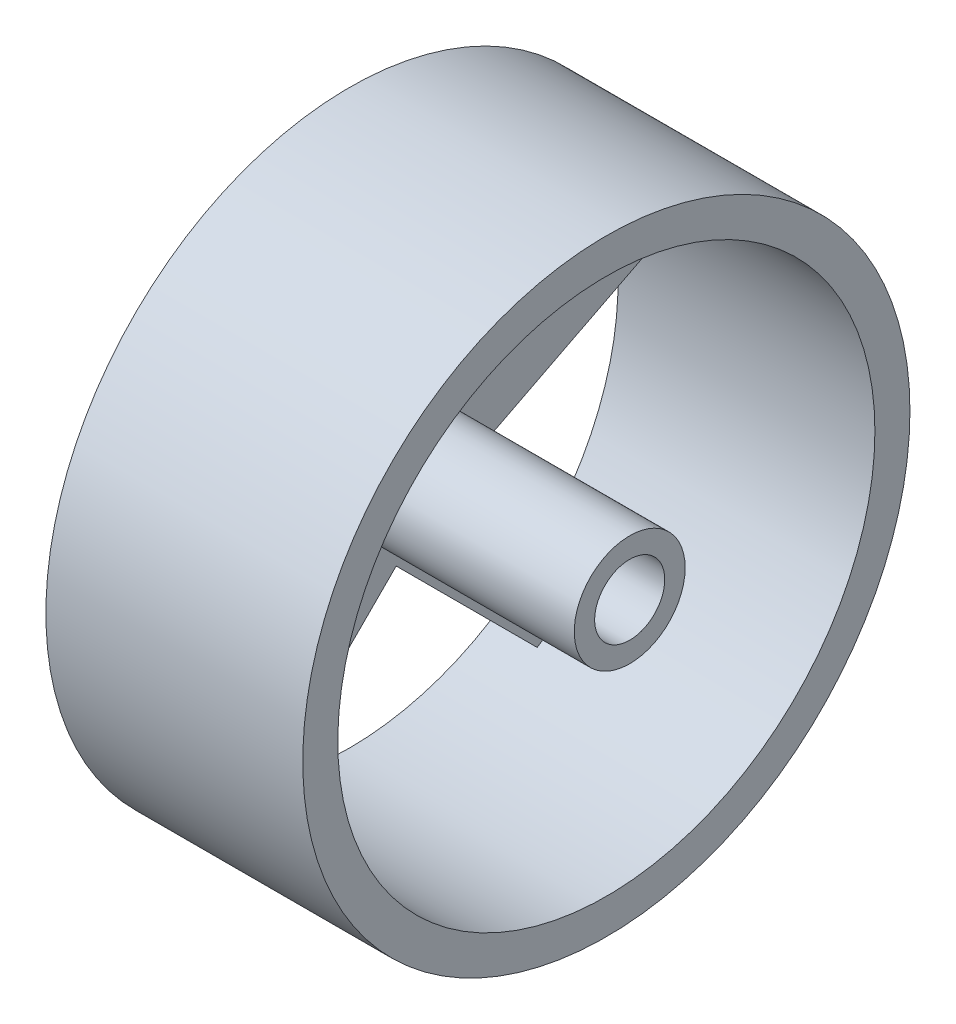
ISO-10303-21;
HEADER;
FILE_DESCRIPTION(('STEP AP214'),'2;1');
FILE_NAME('part.step','',(''),(''),'','','');
FILE_SCHEMA(('AUTOMOTIVE_DESIGN { 1 0 10303 214 1 1 1 1 }'));
ENDSEC;
DATA;
#1=APPLICATION_CONTEXT('core data for automotive mechanical design processes');
#2=APPLICATION_PROTOCOL_DEFINITION('international standard','automotive_design',2000,#1);
#3=PRODUCT_CONTEXT('',#1,'mechanical');
#4=PRODUCT('Part','Part','',(#3));
#5=PRODUCT_RELATED_PRODUCT_CATEGORY('part','',(#4));
#6=PRODUCT_DEFINITION_FORMATION('','',#4);
#7=PRODUCT_DEFINITION_CONTEXT('part definition',#1,'design');
#8=PRODUCT_DEFINITION('design','',#6,#7);
#9=PRODUCT_DEFINITION_SHAPE('','',#8);
#10=(LENGTH_UNIT() NAMED_UNIT(*) SI_UNIT(.MILLI.,.METRE.));
#11=(NAMED_UNIT(*) PLANE_ANGLE_UNIT() SI_UNIT($,.RADIAN.));
#12=(NAMED_UNIT(*) SI_UNIT($,.STERADIAN.) SOLID_ANGLE_UNIT());
#13=UNCERTAINTY_MEASURE_WITH_UNIT(LENGTH_MEASURE(1.E-05),#10,'distance_accuracy_value','');
#14=(GEOMETRIC_REPRESENTATION_CONTEXT(3) GLOBAL_UNCERTAINTY_ASSIGNED_CONTEXT((#13)) GLOBAL_UNIT_ASSIGNED_CONTEXT((#10,
#11,#12)) REPRESENTATION_CONTEXT('',''));
#15=CARTESIAN_POINT('',(0.,0.,0.));
#16=DIRECTION('',(0.,0.,1.));
#17=DIRECTION('',(1.,0.,0.));
#18=AXIS2_PLACEMENT_3D('',#15,#16,#17);
#19=CARTESIAN_POINT('',(4.,0.,0.));
#20=DIRECTION('',(1.,0.,0.));
#21=DIRECTION('',(0.,0.,-1.));
#22=AXIS2_PLACEMENT_3D('',#19,#20,#21);
#23=PLANE('',#22);
#24=DIRECTION('',(0.,-0.987688340595137,-0.156434465040233));
#25=VECTOR('',#24,1.);
#26=CARTESIAN_POINT('',(4.,22.9343179970492,-1.7369680510093));
#27=LINE('',#26,#25);
#28=CARTESIAN_POINT('',(4.,22.9343179970492,-1.7369680510093));
#29=VERTEX_POINT('',#28);
#30=CARTESIAN_POINT('',(4.,6.0676274578121,-4.40838939219355));
#31=VERTEX_POINT('',#30);
#32=EDGE_CURVE('E60',#29,#31,#27,.T.);
#33=ORIENTED_EDGE('',*,*,#32,.F.);
#34=CARTESIAN_POINT('',(4.,0.,0.));
#35=DIRECTION('',(1.,0.,0.));
#36=DIRECTION('',(0.,0.,-1.));
#37=AXIS2_PLACEMENT_3D('',#34,#35,#36);
#38=CIRCLE('',#37,23.);
#39=CARTESIAN_POINT('',(4.,22.9343179970492,1.7369680510093));
#40=VERTEX_POINT('',#39);
#41=EDGE_CURVE('E182',#40,#29,#38,.F.);
#42=ORIENTED_EDGE('',*,*,#41,.F.);
#43=DIRECTION('',(0.,0.987688340595137,-0.156434465040233));
#44=VECTOR('',#43,1.);
#45=CARTESIAN_POINT('',(4.,22.9343179970492,1.7369680510093));
#46=LINE('',#45,#44);
#47=CARTESIAN_POINT('',(4.,6.06762745781211,4.40838939219355));
#48=VERTEX_POINT('',#47);
#49=EDGE_CURVE('E232',#48,#40,#46,.T.);
#50=ORIENTED_EDGE('',*,*,#49,.F.);
#51=DIRECTION('',(0.,-0.156434465040229,-0.987688340595138));
#52=VECTOR('',#51,1.);
#53=CARTESIAN_POINT('',(4.,8.73904879899628,21.2750799314306));
#54=LINE('',#53,#52);
#55=CARTESIAN_POINT('',(4.,8.73904879899628,21.2750799314306));
#56=VERTEX_POINT('',#55);
#57=EDGE_CURVE('E180',#56,#48,#54,.T.);
#58=ORIENTED_EDGE('',*,*,#57,.F.);
#59=CARTESIAN_POINT('',(4.,5.4351392319785,22.348585224327));
#60=VERTEX_POINT('',#59);
#61=EDGE_CURVE('E158',#60,#56,#38,.F.);
#62=ORIENTED_EDGE('',*,*,#61,.F.);
#63=DIRECTION('',(0.,0.453990499739548,0.891006524188367));
#64=VECTOR('',#63,1.);
#65=CARTESIAN_POINT('',(4.,5.4351392319785,22.348585224327));
#66=LINE('',#65,#64);
#67=CARTESIAN_POINT('',(4.,-2.31762745781211,7.13292387221365));
#68=VERTEX_POINT('',#67);
#69=EDGE_CURVE('E169',#68,#60,#66,.T.);
#70=ORIENTED_EDGE('',*,*,#69,.F.);
#71=DIRECTION('',(0.,0.891006524188369,-0.453990499739545));
#72=VECTOR('',#71,1.);
#73=CARTESIAN_POINT('',(4.,-17.5332888099255,14.8856905620042));
#74=LINE('',#73,#72);
#75=CARTESIAN_POINT('',(4.,-17.5332888099255,14.8856905620042));
#76=VERTEX_POINT('',#75);
#77=EDGE_CURVE('E175',#76,#68,#74,.T.);
#78=ORIENTED_EDGE('',*,*,#77,.F.);
#79=CARTESIAN_POINT('',(4.,-19.5752172180984,12.0752172180985));
#80=VERTEX_POINT('',#79);
#81=EDGE_CURVE('E52',#80,#76,#38,.F.);
#82=ORIENTED_EDGE('',*,*,#81,.F.);
#83=DIRECTION('',(0.,-0.707106781186546,0.707106781186549));
#84=VECTOR('',#83,1.);
#85=CARTESIAN_POINT('',(4.,-19.5752172180984,12.0752172180985));
#86=LINE('',#85,#84);
#87=CARTESIAN_POINT('',(4.,-7.5,0.));
#88=VERTEX_POINT('',#87);
#89=EDGE_CURVE('E308',#88,#80,#86,.T.);
#90=ORIENTED_EDGE('',*,*,#89,.F.);
#91=DIRECTION('',(0.,0.707106781186546,0.707106781186549));
#92=VECTOR('',#91,1.);
#93=CARTESIAN_POINT('',(4.,-19.5752172180985,-12.0752172180985));
#94=LINE('',#93,#92);
#95=CARTESIAN_POINT('',(4.,-19.5752172180985,-12.0752172180985));
#96=VERTEX_POINT('',#95);
#97=EDGE_CURVE('E273',#96,#88,#94,.T.);
#98=ORIENTED_EDGE('',*,*,#97,.F.);
#99=CARTESIAN_POINT('',(4.,-17.5332888099255,-14.8856905620042));
#100=VERTEX_POINT('',#99);
#101=EDGE_CURVE('E11',#100,#96,#38,.F.);
#102=ORIENTED_EDGE('',*,*,#101,.F.);
#103=DIRECTION('',(0.,-0.891006524188369,-0.453990499739545));
#104=VECTOR('',#103,1.);
#105=CARTESIAN_POINT('',(4.,-17.5332888099255,-14.8856905620042));
#106=LINE('',#105,#104);
#107=CARTESIAN_POINT('',(4.,-2.31762745781211,-7.13292387221365));
#108=VERTEX_POINT('',#107);
#109=EDGE_CURVE('E253',#108,#100,#106,.T.);
#110=ORIENTED_EDGE('',*,*,#109,.F.);
#111=DIRECTION('',(0.,-0.453990499739549,0.891006524188367));
#112=VECTOR('',#111,1.);
#113=CARTESIAN_POINT('',(4.,5.43513923197851,-22.348585224327));
#114=LINE('',#113,#112);
#115=CARTESIAN_POINT('',(4.,5.43513923197851,-22.348585224327));
#116=VERTEX_POINT('',#115);
#117=EDGE_CURVE('E68',#116,#108,#114,.T.);
#118=ORIENTED_EDGE('',*,*,#117,.F.);
#119=CARTESIAN_POINT('',(4.,8.73904879899628,-21.2750799314306));
#120=VERTEX_POINT('',#119);
#121=EDGE_CURVE('E53',#120,#116,#38,.F.);
#122=ORIENTED_EDGE('',*,*,#121,.F.);
#123=DIRECTION('',(0.,0.156434465040229,-0.987688340595138));
#124=VECTOR('',#123,1.);
#125=CARTESIAN_POINT('',(4.,8.73904879899628,-21.2750799314306));
#126=LINE('',#125,#124);
#127=EDGE_CURVE('E282',#31,#120,#126,.T.);
#128=ORIENTED_EDGE('',*,*,#127,.F.);
#129=EDGE_LOOP('',(#33,#42,#50,#58,#62,#70,#78,#82,#90,#98,#102,#110,#118,#122,#128));
#130=FACE_BOUND('',#129,.T.);
#131=CARTESIAN_POINT('',(4.,0.,0.));
#132=DIRECTION('',(1.,0.,0.));
#133=DIRECTION('',(0.,0.,-1.));
#134=AXIS2_PLACEMENT_3D('',#131,#132,#133);
#135=CIRCLE('',#134,4.75);
#136=CARTESIAN_POINT('',(4.,0.,-4.75));
#137=VERTEX_POINT('',#136);
#138=EDGE_CURVE('E190',#137,#137,#135,.T.);
#139=ORIENTED_EDGE('',*,*,#138,.F.);
#140=EDGE_LOOP('',(#139));
#141=FACE_BOUND('',#140,.T.);
#142=ADVANCED_FACE('F43',(#130,#141),#23,.T.);
#143=CARTESIAN_POINT('',(24.,0.,0.));
#144=DIRECTION('',(-1.,0.,0.));
#145=DIRECTION('',(0.,0.,1.));
#146=AXIS2_PLACEMENT_3D('',#143,#144,#145);
#147=CYLINDRICAL_SURFACE('',#146,4.75);
#148=CARTESIAN_POINT('',(24.,0.,0.));
#149=DIRECTION('',(1.,0.,0.));
#150=DIRECTION('',(0.,0.,-1.));
#151=AXIS2_PLACEMENT_3D('',#148,#149,#150);
#152=CIRCLE('',#151,4.75);
#153=CARTESIAN_POINT('',(24.,0.,-4.75));
#154=VERTEX_POINT('',#153);
#155=EDGE_CURVE('E200',#154,#154,#152,.T.);
#156=ORIENTED_EDGE('',*,*,#155,.F.);
#157=EDGE_LOOP('',(#156));
#158=FACE_BOUND('',#157,.T.);
#159=ORIENTED_EDGE('',*,*,#138,.T.);
#160=EDGE_LOOP('',(#159));
#161=FACE_BOUND('',#160,.T.);
#162=ADVANCED_FACE('F413',(#158,#161),#147,.T.);
#163=CARTESIAN_POINT('',(24.,0.,0.));
#164=DIRECTION('',(1.,0.,0.));
#165=DIRECTION('',(0.,0.,-1.));
#166=AXIS2_PLACEMENT_3D('',#163,#164,#165);
#167=PLANE('',#166);
#168=CARTESIAN_POINT('',(24.,0.,0.));
#169=DIRECTION('',(1.,0.,0.));
#170=DIRECTION('',(0.,0.,-1.));
#171=AXIS2_PLACEMENT_3D('',#168,#169,#170);
#172=CIRCLE('',#171,3.);
#173=CARTESIAN_POINT('',(24.,0.,-3.));
#174=VERTEX_POINT('',#173);
#175=EDGE_CURVE('E206',#174,#174,#172,.T.);
#176=ORIENTED_EDGE('',*,*,#175,.F.);
#177=EDGE_LOOP('',(#176));
#178=FACE_BOUND('',#177,.T.);
#179=ORIENTED_EDGE('',*,*,#155,.T.);
#180=EDGE_LOOP('',(#179));
#181=FACE_BOUND('',#180,.T.);
#182=ADVANCED_FACE('F418',(#178,#181),#167,.T.);
#183=CARTESIAN_POINT('',(4.,0.,0.));
#184=DIRECTION('',(1.,0.,0.));
#185=DIRECTION('',(0.,0.,-1.));
#186=AXIS2_PLACEMENT_3D('',#183,#184,#185);
#187=CYLINDRICAL_SURFACE('',#186,3.);
#188=CARTESIAN_POINT('',(4.,0.,0.));
#189=DIRECTION('',(1.,0.,0.));
#190=DIRECTION('',(0.,0.,-1.));
#191=AXIS2_PLACEMENT_3D('',#188,#189,#190);
#192=CIRCLE('',#191,3.);
#193=CARTESIAN_POINT('',(4.,0.,-3.));
#194=VERTEX_POINT('',#193);
#195=EDGE_CURVE('E205',#194,#194,#192,.T.);
#196=ORIENTED_EDGE('',*,*,#195,.F.);
#197=EDGE_LOOP('',(#196));
#198=FACE_BOUND('',#197,.T.);
#199=ORIENTED_EDGE('',*,*,#175,.T.);
#200=EDGE_LOOP('',(#199));
#201=FACE_BOUND('',#200,.T.);
#202=ADVANCED_FACE('F424',(#198,#201),#187,.F.);
#203=CARTESIAN_POINT('',(4.,0.,0.));
#204=DIRECTION('',(1.,0.,0.));
#205=DIRECTION('',(0.,0.,-1.));
#206=AXIS2_PLACEMENT_3D('',#203,#204,#205);
#207=PLANE('',#206);
#208=ORIENTED_EDGE('',*,*,#195,.T.);
#209=EDGE_LOOP('',(#208));
#210=FACE_BOUND('',#209,.T.);
#211=ADVANCED_FACE('F403',(#210),#207,.T.);
#212=CARTESIAN_POINT('',(22.,0.,0.));
#213=DIRECTION('',(1.,0.,0.));
#214=DIRECTION('',(0.,0.,-1.));
#215=AXIS2_PLACEMENT_3D('',#212,#213,#214);
#216=PLANE('',#215);
#217=CARTESIAN_POINT('',(22.,0.,0.));
#218=DIRECTION('',(1.,0.,0.));
#219=DIRECTION('',(0.,0.,-1.));
#220=AXIS2_PLACEMENT_3D('',#217,#218,#219);
#221=CIRCLE('',#220,26.);
#222=CARTESIAN_POINT('',(22.,0.,-26.));
#223=VERTEX_POINT('',#222);
#224=EDGE_CURVE('E210',#223,#223,#221,.T.);
#225=ORIENTED_EDGE('',*,*,#224,.T.);
#226=EDGE_LOOP('',(#225));
#227=FACE_BOUND('',#226,.T.);
#228=CARTESIAN_POINT('',(22.,0.,0.));
#229=DIRECTION('',(1.,0.,0.));
#230=DIRECTION('',(0.,0.,-1.));
#231=AXIS2_PLACEMENT_3D('',#228,#229,#230);
#232=CIRCLE('',#231,23.);
#233=CARTESIAN_POINT('',(22.,0.,-23.));
#234=VERTEX_POINT('',#233);
#235=EDGE_CURVE('E217',#234,#234,#232,.T.);
#236=ORIENTED_EDGE('',*,*,#235,.F.);
#237=EDGE_LOOP('',(#236));
#238=FACE_BOUND('',#237,.T.);
#239=ADVANCED_FACE('F400',(#227,#238),#216,.T.);
#240=CARTESIAN_POINT('',(22.,0.,0.));
#241=DIRECTION('',(-1.,0.,0.));
#242=DIRECTION('',(0.,0.,1.));
#243=AXIS2_PLACEMENT_3D('',#240,#241,#242);
#244=CYLINDRICAL_SURFACE('',#243,23.);
#245=ORIENTED_EDGE('',*,*,#235,.T.);
#246=EDGE_LOOP('',(#245));
#247=FACE_BOUND('',#246,.T.);
#248=ORIENTED_EDGE('',*,*,#101,.T.);
#249=DIRECTION('',(1.,0.,0.));
#250=VECTOR('',#249,1.);
#251=CARTESIAN_POINT('',(0.,-19.5752172180985,-12.0752172180985));
#252=LINE('',#251,#250);
#253=CARTESIAN_POINT('',(0.,-19.5752172180985,-12.0752172180985));
#254=VERTEX_POINT('',#253);
#255=EDGE_CURVE('E317',#254,#96,#252,.T.);
#256=ORIENTED_EDGE('',*,*,#255,.F.);
#257=CARTESIAN_POINT('',(0.,0.,0.));
#258=DIRECTION('',(1.,0.,0.));
#259=DIRECTION('',(0.,0.,-1.));
#260=AXIS2_PLACEMENT_3D('',#257,#258,#259);
#261=CIRCLE('',#260,23.);
#262=CARTESIAN_POINT('',(0.,-19.5752172180984,12.0752172180985));
#263=VERTEX_POINT('',#262);
#264=EDGE_CURVE('E304',#263,#254,#261,.T.);
#265=ORIENTED_EDGE('',*,*,#264,.F.);
#266=DIRECTION('',(1.,0.,0.));
#267=VECTOR('',#266,1.);
#268=CARTESIAN_POINT('',(0.,-19.5752172180984,12.0752172180985));
#269=LINE('',#268,#267);
#270=EDGE_CURVE('E323',#263,#80,#269,.T.);
#271=ORIENTED_EDGE('',*,*,#270,.T.);
#272=ORIENTED_EDGE('',*,*,#81,.T.);
#273=DIRECTION('',(1.,0.,0.));
#274=VECTOR('',#273,1.);
#275=CARTESIAN_POINT('',(0.,-17.5332888099255,14.8856905620042));
#276=LINE('',#275,#274);
#277=CARTESIAN_POINT('',(0.,-17.5332888099255,14.8856905620042));
#278=VERTEX_POINT('',#277);
#279=EDGE_CURVE('E341',#278,#76,#276,.T.);
#280=ORIENTED_EDGE('',*,*,#279,.F.);
#281=CARTESIAN_POINT('',(0.,0.,0.));
#282=DIRECTION('',(1.,0.,0.));
#283=DIRECTION('',(0.,0.,-1.));
#284=AXIS2_PLACEMENT_3D('',#281,#282,#283);
#285=CIRCLE('',#284,23.);
#286=CARTESIAN_POINT('',(0.,5.4351392319785,22.348585224327));
#287=VERTEX_POINT('',#286);
#288=EDGE_CURVE('E160',#287,#278,#285,.T.);
#289=ORIENTED_EDGE('',*,*,#288,.F.);
#290=DIRECTION('',(1.,0.,0.));
#291=VECTOR('',#290,1.);
#292=CARTESIAN_POINT('',(0.,5.4351392319785,22.348585224327));
#293=LINE('',#292,#291);
#294=EDGE_CURVE('E154',#287,#60,#293,.T.);
#295=ORIENTED_EDGE('',*,*,#294,.T.);
#296=ORIENTED_EDGE('',*,*,#61,.T.);
#297=DIRECTION('',(1.,0.,0.));
#298=VECTOR('',#297,1.);
#299=CARTESIAN_POINT('',(0.,8.73904879899628,21.2750799314306));
#300=LINE('',#299,#298);
#301=CARTESIAN_POINT('',(0.,8.73904879899628,21.2750799314306));
#302=VERTEX_POINT('',#301);
#303=EDGE_CURVE('E222',#302,#56,#300,.T.);
#304=ORIENTED_EDGE('',*,*,#303,.F.);
#305=CARTESIAN_POINT('',(0.,0.,0.));
#306=DIRECTION('',(1.,0.,0.));
#307=DIRECTION('',(0.,0.,-1.));
#308=AXIS2_PLACEMENT_3D('',#305,#306,#307);
#309=CIRCLE('',#308,23.);
#310=CARTESIAN_POINT('',(0.,22.9343179970492,1.7369680510093));
#311=VERTEX_POINT('',#310);
#312=EDGE_CURVE('E236',#311,#302,#309,.T.);
#313=ORIENTED_EDGE('',*,*,#312,.F.);
#314=DIRECTION('',(1.,0.,0.));
#315=VECTOR('',#314,1.);
#316=CARTESIAN_POINT('',(0.,22.9343179970492,1.7369680510093));
#317=LINE('',#316,#315);
#318=EDGE_CURVE('E221',#311,#40,#317,.T.);
#319=ORIENTED_EDGE('',*,*,#318,.T.);
#320=ORIENTED_EDGE('',*,*,#41,.T.);
#321=DIRECTION('',(1.,0.,0.));
#322=VECTOR('',#321,1.);
#323=CARTESIAN_POINT('',(0.,22.9343179970492,-1.7369680510093));
#324=LINE('',#323,#322);
#325=CARTESIAN_POINT('',(0.,22.9343179970492,-1.7369680510093));
#326=VERTEX_POINT('',#325);
#327=EDGE_CURVE('E291',#326,#29,#324,.T.);
#328=ORIENTED_EDGE('',*,*,#327,.F.);
#329=CARTESIAN_POINT('',(0.,0.,0.));
#330=DIRECTION('',(1.,0.,0.));
#331=DIRECTION('',(0.,0.,-1.));
#332=AXIS2_PLACEMENT_3D('',#329,#330,#331);
#333=CIRCLE('',#332,23.);
#334=CARTESIAN_POINT('',(0.,8.73904879899628,-21.2750799314306));
#335=VERTEX_POINT('',#334);
#336=EDGE_CURVE('E278',#335,#326,#333,.T.);
#337=ORIENTED_EDGE('',*,*,#336,.F.);
#338=DIRECTION('',(1.,0.,0.));
#339=VECTOR('',#338,1.);
#340=CARTESIAN_POINT('',(0.,8.73904879899628,-21.2750799314306));
#341=LINE('',#340,#339);
#342=EDGE_CURVE('E265',#335,#120,#341,.T.);
#343=ORIENTED_EDGE('',*,*,#342,.T.);
#344=ORIENTED_EDGE('',*,*,#121,.T.);
#345=DIRECTION('',(1.,0.,0.));
#346=VECTOR('',#345,1.);
#347=CARTESIAN_POINT('',(0.,5.43513923197851,-22.348585224327));
#348=LINE('',#347,#346);
#349=CARTESIAN_POINT('',(0.,5.43513923197851,-22.348585224327));
#350=VERTEX_POINT('',#349);
#351=EDGE_CURVE('E262',#350,#116,#348,.T.);
#352=ORIENTED_EDGE('',*,*,#351,.F.);
#353=CARTESIAN_POINT('',(0.,0.,0.));
#354=DIRECTION('',(1.,0.,0.));
#355=DIRECTION('',(0.,0.,-1.));
#356=AXIS2_PLACEMENT_3D('',#353,#354,#355);
#357=CIRCLE('',#356,23.);
#358=CARTESIAN_POINT('',(0.,-17.5332888099255,-14.8856905620042));
#359=VERTEX_POINT('',#358);
#360=EDGE_CURVE('E249',#359,#350,#357,.T.);
#361=ORIENTED_EDGE('',*,*,#360,.F.);
#362=DIRECTION('',(1.,0.,0.));
#363=VECTOR('',#362,1.);
#364=CARTESIAN_POINT('',(0.,-17.5332888099255,-14.8856905620042));
#365=LINE('',#364,#363);
#366=EDGE_CURVE('E269',#359,#100,#365,.T.);
#367=ORIENTED_EDGE('',*,*,#366,.T.);
#368=EDGE_LOOP('',(#248,#256,#265,#271,#272,#280,#289,#295,#296,#304,#313,#319,#320,#328,#337,
#343,#344,#352,#361,#367));
#369=FACE_BOUND('',#368,.T.);
#370=ADVANCED_FACE('F156',(#247,#369),#244,.F.);
#371=CARTESIAN_POINT('',(0.,0.,0.));
#372=DIRECTION('',(1.,0.,0.));
#373=DIRECTION('',(0.,0.,-1.));
#374=AXIS2_PLACEMENT_3D('',#371,#372,#373);
#375=PLANE('',#374);
#376=CARTESIAN_POINT('',(0.,0.,0.));
#377=DIRECTION('',(-1.,0.,0.));
#378=DIRECTION('',(0.,0.,1.));
#379=AXIS2_PLACEMENT_3D('',#376,#377,#378);
#380=CIRCLE('',#379,5.);
#381=CARTESIAN_POINT('',(0.,0.,5.));
#382=VERTEX_POINT('',#381);
#383=EDGE_CURVE('E348',#382,#382,#380,.T.);
#384=ORIENTED_EDGE('',*,*,#383,.F.);
#385=EDGE_LOOP('',(#384));
#386=FACE_BOUND('',#385,.T.);
#387=DIRECTION('',(0.,0.156434465040229,-0.987688340595138));
#388=VECTOR('',#387,1.);
#389=CARTESIAN_POINT('',(0.,8.73904879899628,-21.2750799314306));
#390=LINE('',#389,#388);
#391=CARTESIAN_POINT('',(0.,6.0676274578121,-4.40838939219355));
#392=VERTEX_POINT('',#391);
#393=EDGE_CURVE('E287',#392,#335,#390,.T.);
#394=ORIENTED_EDGE('',*,*,#393,.T.);
#395=ORIENTED_EDGE('',*,*,#336,.T.);
#396=DIRECTION('',(0.,-0.987688340595137,-0.156434465040233));
#397=VECTOR('',#396,1.);
#398=CARTESIAN_POINT('',(0.,22.9343179970492,-1.7369680510093));
#399=LINE('',#398,#397);
#400=EDGE_CURVE('E283',#326,#392,#399,.T.);
#401=ORIENTED_EDGE('',*,*,#400,.T.);
#402=EDGE_LOOP('',(#394,#395,#401));
#403=FACE_BOUND('',#402,.T.);
#404=DIRECTION('',(0.,-0.891006524188369,-0.453990499739545));
#405=VECTOR('',#404,1.);
#406=CARTESIAN_POINT('',(0.,-17.5332888099255,-14.8856905620042));
#407=LINE('',#406,#405);
#408=CARTESIAN_POINT('',(0.,-2.3176274578121,-7.13292387221365));
#409=VERTEX_POINT('',#408);
#410=EDGE_CURVE('E258',#409,#359,#407,.T.);
#411=ORIENTED_EDGE('',*,*,#410,.T.);
#412=ORIENTED_EDGE('',*,*,#360,.T.);
#413=DIRECTION('',(0.,-0.453990499739549,0.891006524188367));
#414=VECTOR('',#413,1.);
#415=CARTESIAN_POINT('',(0.,5.43513923197851,-22.348585224327));
#416=LINE('',#415,#414);
#417=EDGE_CURVE('E254',#350,#409,#416,.T.);
#418=ORIENTED_EDGE('',*,*,#417,.T.);
#419=EDGE_LOOP('',(#411,#412,#418));
#420=FACE_BOUND('',#419,.T.);
#421=DIRECTION('',(0.,0.453990499739548,0.891006524188367));
#422=VECTOR('',#421,1.);
#423=CARTESIAN_POINT('',(0.,5.4351392319785,22.348585224327));
#424=LINE('',#423,#422);
#425=CARTESIAN_POINT('',(0.,-2.31762745781211,7.13292387221365));
#426=VERTEX_POINT('',#425);
#427=EDGE_CURVE('E338',#426,#287,#424,.T.);
#428=ORIENTED_EDGE('',*,*,#427,.T.);
#429=ORIENTED_EDGE('',*,*,#288,.T.);
#430=DIRECTION('',(0.,0.891006524188369,-0.453990499739545));
#431=VECTOR('',#430,1.);
#432=CARTESIAN_POINT('',(0.,-17.5332888099255,14.8856905620042));
#433=LINE('',#432,#431);
#434=EDGE_CURVE('E334',#278,#426,#433,.T.);
#435=ORIENTED_EDGE('',*,*,#434,.T.);
#436=EDGE_LOOP('',(#428,#429,#435));
#437=FACE_BOUND('',#436,.T.);
#438=DIRECTION('',(0.,-0.707106781186546,0.707106781186549));
#439=VECTOR('',#438,1.);
#440=CARTESIAN_POINT('',(0.,-19.5752172180984,12.0752172180985));
#441=LINE('',#440,#439);
#442=CARTESIAN_POINT('',(0.,-7.5,0.));
#443=VERTEX_POINT('',#442);
#444=EDGE_CURVE('E313',#443,#263,#441,.T.);
#445=ORIENTED_EDGE('',*,*,#444,.T.);
#446=ORIENTED_EDGE('',*,*,#264,.T.);
#447=DIRECTION('',(0.,0.707106781186546,0.707106781186549));
#448=VECTOR('',#447,1.);
#449=CARTESIAN_POINT('',(0.,-19.5752172180985,-12.0752172180985));
#450=LINE('',#449,#448);
#451=EDGE_CURVE('E309',#254,#443,#450,.T.);
#452=ORIENTED_EDGE('',*,*,#451,.T.);
#453=EDGE_LOOP('',(#445,#446,#452));
#454=FACE_BOUND('',#453,.T.);
#455=DIRECTION('',(0.,0.987688340595137,-0.156434465040233));
#456=VECTOR('',#455,1.);
#457=CARTESIAN_POINT('',(0.,22.9343179970492,1.7369680510093));
#458=LINE('',#457,#456);
#459=CARTESIAN_POINT('',(0.,6.06762745781211,4.40838939219355));
#460=VERTEX_POINT('',#459);
#461=EDGE_CURVE('E226',#460,#311,#458,.T.);
#462=ORIENTED_EDGE('',*,*,#461,.T.);
#463=ORIENTED_EDGE('',*,*,#312,.T.);
#464=DIRECTION('',(0.,-0.156434465040229,-0.987688340595138));
#465=VECTOR('',#464,1.);
#466=CARTESIAN_POINT('',(0.,8.73904879899628,21.2750799314306));
#467=LINE('',#466,#465);
#468=EDGE_CURVE('E242',#302,#460,#467,.T.);
#469=ORIENTED_EDGE('',*,*,#468,.T.);
#470=EDGE_LOOP('',(#462,#463,#469));
#471=FACE_BOUND('',#470,.T.);
#472=CARTESIAN_POINT('',(0.,0.,0.));
#473=DIRECTION('',(1.,0.,0.));
#474=DIRECTION('',(0.,0.,-1.));
#475=AXIS2_PLACEMENT_3D('',#472,#473,#474);
#476=CIRCLE('',#475,26.);
#477=CARTESIAN_POINT('',(0.,0.,-26.));
#478=VERTEX_POINT('',#477);
#479=EDGE_CURVE('E194',#478,#478,#476,.T.);
#480=ORIENTED_EDGE('',*,*,#479,.F.);
#481=EDGE_LOOP('',(#480));
#482=FACE_BOUND('',#481,.T.);
#483=ADVANCED_FACE('F385',(#386,#403,#420,#437,#454,#471,#482),#375,.F.);
#484=CARTESIAN_POINT('',(4.,0.,0.));
#485=DIRECTION('',(-1.,0.,0.));
#486=DIRECTION('',(0.,0.,1.));
#487=AXIS2_PLACEMENT_3D('',#484,#485,#486);
#488=CYLINDRICAL_SURFACE('',#487,26.);
#489=ORIENTED_EDGE('',*,*,#479,.T.);
#490=EDGE_LOOP('',(#489));
#491=FACE_BOUND('',#490,.T.);
#492=ORIENTED_EDGE('',*,*,#224,.F.);
#493=EDGE_LOOP('',(#492));
#494=FACE_BOUND('',#493,.T.);
#495=ADVANCED_FACE('F45',(#491,#494),#488,.T.);
#496=CARTESIAN_POINT('',(0.,22.9343179970492,1.7369680510093));
#497=DIRECTION('',(0.,-0.156434465040233,-0.987688340595138));
#498=DIRECTION('',(0.,0.987688340595137,-0.156434465040233));
#499=AXIS2_PLACEMENT_3D('',#496,#497,#498);
#500=PLANE('',#499);
#501=ORIENTED_EDGE('',*,*,#49,.T.);
#502=ORIENTED_EDGE('',*,*,#318,.F.);
#503=ORIENTED_EDGE('',*,*,#461,.F.);
#504=DIRECTION('',(1.,0.,0.));
#505=VECTOR('',#504,1.);
#506=CARTESIAN_POINT('',(0.,6.06762745781211,4.40838939219355));
#507=LINE('',#506,#505);
#508=EDGE_CURVE('E225',#460,#48,#507,.T.);
#509=ORIENTED_EDGE('',*,*,#508,.T.);
#510=EDGE_LOOP('',(#501,#502,#503,#509));
#511=FACE_BOUND('',#510,.T.);
#512=ADVANCED_FACE('F397',(#511),#500,.F.);
#513=CARTESIAN_POINT('',(0.,8.73904879899628,21.2750799314306));
#514=DIRECTION('',(0.,-0.987688340595138,0.156434465040229));
#515=DIRECTION('',(0.,-0.156434465040229,-0.987688340595138));
#516=AXIS2_PLACEMENT_3D('',#513,#514,#515);
#517=PLANE('',#516);
#518=ORIENTED_EDGE('',*,*,#57,.T.);
#519=ORIENTED_EDGE('',*,*,#508,.F.);
#520=ORIENTED_EDGE('',*,*,#468,.F.);
#521=ORIENTED_EDGE('',*,*,#303,.T.);
#522=EDGE_LOOP('',(#518,#519,#520,#521));
#523=FACE_BOUND('',#522,.T.);
#524=ADVANCED_FACE('F473',(#523),#517,.F.);
#525=CARTESIAN_POINT('',(0.,-19.5752172180984,12.0752172180985));
#526=DIRECTION('',(0.,0.707106781186549,0.707106781186546));
#527=DIRECTION('',(0.,-0.707106781186546,0.707106781186549));
#528=AXIS2_PLACEMENT_3D('',#525,#526,#527);
#529=PLANE('',#528);
#530=ORIENTED_EDGE('',*,*,#89,.T.);
#531=ORIENTED_EDGE('',*,*,#270,.F.);
#532=ORIENTED_EDGE('',*,*,#444,.F.);
#533=DIRECTION('',(1.,0.,0.));
#534=VECTOR('',#533,1.);
#535=CARTESIAN_POINT('',(0.,-7.5,0.));
#536=LINE('',#535,#534);
#537=EDGE_CURVE('E326',#443,#88,#536,.T.);
#538=ORIENTED_EDGE('',*,*,#537,.T.);
#539=EDGE_LOOP('',(#530,#531,#532,#538));
#540=FACE_BOUND('',#539,.T.);
#541=ADVANCED_FACE('F484',(#540),#529,.F.);
#542=CARTESIAN_POINT('',(0.,-19.5752172180985,-12.0752172180985));
#543=DIRECTION('',(0.,0.707106781186549,-0.707106781186546));
#544=DIRECTION('',(0.,0.707106781186546,0.707106781186549));
#545=AXIS2_PLACEMENT_3D('',#542,#543,#544);
#546=PLANE('',#545);
#547=ORIENTED_EDGE('',*,*,#97,.T.);
#548=ORIENTED_EDGE('',*,*,#537,.F.);
#549=ORIENTED_EDGE('',*,*,#451,.F.);
#550=ORIENTED_EDGE('',*,*,#255,.T.);
#551=EDGE_LOOP('',(#547,#548,#549,#550));
#552=FACE_BOUND('',#551,.T.);
#553=ADVANCED_FACE('F494',(#552),#546,.F.);
#554=CARTESIAN_POINT('',(0.,5.4351392319785,22.348585224327));
#555=DIRECTION('',(0.,0.891006524188367,-0.453990499739548));
#556=DIRECTION('',(0.,0.453990499739549,0.891006524188367));
#557=AXIS2_PLACEMENT_3D('',#554,#555,#556);
#558=PLANE('',#557);
#559=ORIENTED_EDGE('',*,*,#69,.T.);
#560=ORIENTED_EDGE('',*,*,#294,.F.);
#561=ORIENTED_EDGE('',*,*,#427,.F.);
#562=DIRECTION('',(1.,0.,0.));
#563=VECTOR('',#562,1.);
#564=CARTESIAN_POINT('',(0.,-2.31762745781211,7.13292387221365));
#565=LINE('',#564,#563);
#566=EDGE_CURVE('E164',#426,#68,#565,.T.);
#567=ORIENTED_EDGE('',*,*,#566,.T.);
#568=EDGE_LOOP('',(#559,#560,#561,#567));
#569=FACE_BOUND('',#568,.T.);
#570=ADVANCED_FACE('F170',(#569),#558,.F.);
#571=CARTESIAN_POINT('',(0.,-17.5332888099255,14.8856905620042));
#572=DIRECTION('',(0.,-0.453990499739545,-0.891006524188369));
#573=DIRECTION('',(0.,0.891006524188369,-0.453990499739545));
#574=AXIS2_PLACEMENT_3D('',#571,#572,#573);
#575=PLANE('',#574);
#576=ORIENTED_EDGE('',*,*,#77,.T.);
#577=ORIENTED_EDGE('',*,*,#566,.F.);
#578=ORIENTED_EDGE('',*,*,#434,.F.);
#579=ORIENTED_EDGE('',*,*,#279,.T.);
#580=EDGE_LOOP('',(#576,#577,#578,#579));
#581=FACE_BOUND('',#580,.T.);
#582=ADVANCED_FACE('F515',(#581),#575,.F.);
#583=CARTESIAN_POINT('',(0.,-17.5332888099255,-14.8856905620042));
#584=DIRECTION('',(0.,-0.453990499739545,0.891006524188369));
#585=DIRECTION('',(0.,-0.891006524188369,-0.453990499739545));
#586=AXIS2_PLACEMENT_3D('',#583,#584,#585);
#587=PLANE('',#586);
#588=ORIENTED_EDGE('',*,*,#109,.T.);
#589=ORIENTED_EDGE('',*,*,#366,.F.);
#590=ORIENTED_EDGE('',*,*,#410,.F.);
#591=DIRECTION('',(1.,0.,0.));
#592=VECTOR('',#591,1.);
#593=CARTESIAN_POINT('',(0.,-2.31762745781211,-7.13292387221365));
#594=LINE('',#593,#592);
#595=EDGE_CURVE('E272',#409,#108,#594,.T.);
#596=ORIENTED_EDGE('',*,*,#595,.T.);
#597=EDGE_LOOP('',(#588,#589,#590,#596));
#598=FACE_BOUND('',#597,.T.);
#599=ADVANCED_FACE('F525',(#598),#587,.F.);
#600=CARTESIAN_POINT('',(0.,5.43513923197851,-22.348585224327));
#601=DIRECTION('',(0.,0.891006524188367,0.453990499739549));
#602=DIRECTION('',(0.,-0.453990499739549,0.891006524188367));
#603=AXIS2_PLACEMENT_3D('',#600,#601,#602);
#604=PLANE('',#603);
#605=ORIENTED_EDGE('',*,*,#117,.T.);
#606=ORIENTED_EDGE('',*,*,#595,.F.);
#607=ORIENTED_EDGE('',*,*,#417,.F.);
#608=ORIENTED_EDGE('',*,*,#351,.T.);
#609=EDGE_LOOP('',(#605,#606,#607,#608));
#610=FACE_BOUND('',#609,.T.);
#611=ADVANCED_FACE('F536',(#610),#604,.F.);
#612=CARTESIAN_POINT('',(0.,8.73904879899628,-21.2750799314306));
#613=DIRECTION('',(0.,-0.987688340595138,-0.156434465040229));
#614=DIRECTION('',(0.,0.156434465040229,-0.987688340595138));
#615=AXIS2_PLACEMENT_3D('',#612,#613,#614);
#616=PLANE('',#615);
#617=ORIENTED_EDGE('',*,*,#127,.T.);
#618=ORIENTED_EDGE('',*,*,#342,.F.);
#619=ORIENTED_EDGE('',*,*,#393,.F.);
#620=DIRECTION('',(1.,0.,0.));
#621=VECTOR('',#620,1.);
#622=CARTESIAN_POINT('',(0.,6.0676274578121,-4.40838939219355));
#623=LINE('',#622,#621);
#624=EDGE_CURVE('E299',#392,#31,#623,.T.);
#625=ORIENTED_EDGE('',*,*,#624,.T.);
#626=EDGE_LOOP('',(#617,#618,#619,#625));
#627=FACE_BOUND('',#626,.T.);
#628=ADVANCED_FACE('F547',(#627),#616,.F.);
#629=CARTESIAN_POINT('',(0.,22.9343179970492,-1.7369680510093));
#630=DIRECTION('',(0.,-0.156434465040233,0.987688340595137));
#631=DIRECTION('',(0.,-0.987688340595138,-0.156434465040233));
#632=AXIS2_PLACEMENT_3D('',#629,#630,#631);
#633=PLANE('',#632);
#634=ORIENTED_EDGE('',*,*,#32,.T.);
#635=ORIENTED_EDGE('',*,*,#624,.F.);
#636=ORIENTED_EDGE('',*,*,#400,.F.);
#637=ORIENTED_EDGE('',*,*,#327,.T.);
#638=EDGE_LOOP('',(#634,#635,#636,#637));
#639=FACE_BOUND('',#638,.T.);
#640=ADVANCED_FACE('F381',(#639),#633,.F.);
#641=CARTESIAN_POINT('',(2.,0.,0.));
#642=DIRECTION('',(-1.,0.,0.));
#643=DIRECTION('',(0.,0.,1.));
#644=AXIS2_PLACEMENT_3D('',#641,#642,#643);
#645=CYLINDRICAL_SURFACE('',#644,5.);
#646=CARTESIAN_POINT('',(2.,0.,0.));
#647=DIRECTION('',(-1.,0.,0.));
#648=DIRECTION('',(0.,0.,1.));
#649=AXIS2_PLACEMENT_3D('',#646,#647,#648);
#650=CIRCLE('',#649,5.);
#651=CARTESIAN_POINT('',(2.,0.,5.));
#652=VERTEX_POINT('',#651);
#653=EDGE_CURVE('E165',#652,#652,#650,.T.);
#654=ORIENTED_EDGE('',*,*,#653,.F.);
#655=EDGE_LOOP('',(#654));
#656=FACE_BOUND('',#655,.T.);
#657=ORIENTED_EDGE('',*,*,#383,.T.);
#658=EDGE_LOOP('',(#657));
#659=FACE_BOUND('',#658,.T.);
#660=ADVANCED_FACE('F375',(#656,#659),#645,.F.);
#661=CARTESIAN_POINT('',(2.,0.,0.));
#662=DIRECTION('',(-1.,0.,0.));
#663=DIRECTION('',(0.,0.,1.));
#664=AXIS2_PLACEMENT_3D('',#661,#662,#663);
#665=PLANE('',#664);
#666=CARTESIAN_POINT('',(2.,0.,0.));
#667=DIRECTION('',(-1.,0.,0.));
#668=DIRECTION('',(0.,0.,1.));
#669=AXIS2_PLACEMENT_3D('',#666,#667,#668);
#670=CIRCLE('',#669,2.5);
#671=CARTESIAN_POINT('',(2.,0.,2.5));
#672=VERTEX_POINT('',#671);
#673=EDGE_CURVE('E356',#672,#672,#670,.T.);
#674=ORIENTED_EDGE('',*,*,#673,.F.);
#675=EDGE_LOOP('',(#674));
#676=FACE_BOUND('',#675,.T.);
#677=ORIENTED_EDGE('',*,*,#653,.T.);
#678=EDGE_LOOP('',(#677));
#679=FACE_BOUND('',#678,.T.);
#680=ADVANCED_FACE('F369',(#676,#679),#665,.T.);
#681=CARTESIAN_POINT('',(-1.,0.,0.));
#682=DIRECTION('',(1.,0.,0.));
#683=DIRECTION('',(0.,0.,-1.));
#684=AXIS2_PLACEMENT_3D('',#681,#682,#683);
#685=CYLINDRICAL_SURFACE('',#684,2.5);
#686=CARTESIAN_POINT('',(-1.,0.,0.));
#687=DIRECTION('',(-1.,0.,0.));
#688=DIRECTION('',(0.,0.,1.));
#689=AXIS2_PLACEMENT_3D('',#686,#687,#688);
#690=CIRCLE('',#689,2.5);
#691=CARTESIAN_POINT('',(-1.,0.,2.5));
#692=VERTEX_POINT('',#691);
#693=EDGE_CURVE('E352',#692,#692,#690,.T.);
#694=ORIENTED_EDGE('',*,*,#693,.F.);
#695=EDGE_LOOP('',(#694));
#696=FACE_BOUND('',#695,.T.);
#697=ORIENTED_EDGE('',*,*,#673,.T.);
#698=EDGE_LOOP('',(#697));
#699=FACE_BOUND('',#698,.T.);
#700=ADVANCED_FACE('F366',(#696,#699),#685,.T.);
#701=CARTESIAN_POINT('',(-1.,0.,0.));
#702=DIRECTION('',(-1.,0.,0.));
#703=DIRECTION('',(0.,0.,1.));
#704=AXIS2_PLACEMENT_3D('',#701,#702,#703);
#705=PLANE('',#704);
#706=ORIENTED_EDGE('',*,*,#693,.T.);
#707=EDGE_LOOP('',(#706));
#708=FACE_BOUND('',#707,.T.);
#709=ADVANCED_FACE('F364',(#708),#705,.T.);
#710=CLOSED_SHELL('',(#142,#162,#182,#202,#211,#239,#370,#483,#495,#512,#524,#541,#553,#570,
#582,#599,#611,#628,#640,#660,#680,#700,#709));
#711=MANIFOLD_SOLID_BREP('B2',#710);
#712=ADVANCED_BREP_SHAPE_REPRESENTATION('',(#18,#711),#14);
#713=SHAPE_DEFINITION_REPRESENTATION(#9,#712);
ENDSEC;
END-ISO-10303-21;
